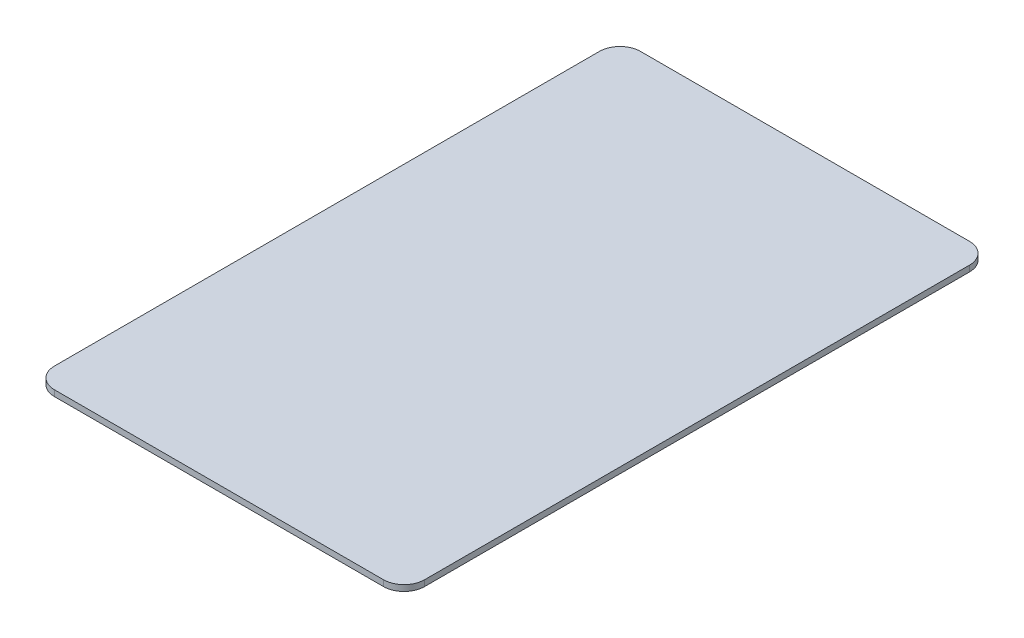
ISO-10303-21;
HEADER;
FILE_DESCRIPTION(('STEP AP214'),'2;1');
FILE_NAME('part.step','',(''),(''),'','','');
FILE_SCHEMA(('AUTOMOTIVE_DESIGN { 1 0 10303 214 1 1 1 1 }'));
ENDSEC;
DATA;
#1=APPLICATION_CONTEXT('core data for automotive mechanical design processes');
#2=APPLICATION_PROTOCOL_DEFINITION('international standard','automotive_design',2000,#1);
#3=PRODUCT_CONTEXT('',#1,'mechanical');
#4=PRODUCT('Part','Part','',(#3));
#5=PRODUCT_RELATED_PRODUCT_CATEGORY('part','',(#4));
#6=PRODUCT_DEFINITION_FORMATION('','',#4);
#7=PRODUCT_DEFINITION_CONTEXT('part definition',#1,'design');
#8=PRODUCT_DEFINITION('design','',#6,#7);
#9=PRODUCT_DEFINITION_SHAPE('','',#8);
#10=(LENGTH_UNIT() NAMED_UNIT(*) SI_UNIT(.MILLI.,.METRE.));
#11=(NAMED_UNIT(*) PLANE_ANGLE_UNIT() SI_UNIT($,.RADIAN.));
#12=(NAMED_UNIT(*) SI_UNIT($,.STERADIAN.) SOLID_ANGLE_UNIT());
#13=UNCERTAINTY_MEASURE_WITH_UNIT(LENGTH_MEASURE(1.E-05),#10,'distance_accuracy_value','');
#14=(GEOMETRIC_REPRESENTATION_CONTEXT(3) GLOBAL_UNCERTAINTY_ASSIGNED_CONTEXT((#13)) GLOBAL_UNIT_ASSIGNED_CONTEXT((#10,
#11,#12)) REPRESENTATION_CONTEXT('',''));
#15=CARTESIAN_POINT('',(0.,0.,0.));
#16=DIRECTION('',(0.,0.,1.));
#17=DIRECTION('',(1.,0.,0.));
#18=AXIS2_PLACEMENT_3D('',#15,#16,#17);
#19=CARTESIAN_POINT('',(24.,0.87,-39.75));
#20=DIRECTION('',(0.,-1.,0.));
#21=DIRECTION('',(0.,0.,-1.));
#22=AXIS2_PLACEMENT_3D('',#19,#20,#21);
#23=CYLINDRICAL_SURFACE('',#22,3.);
#24=CARTESIAN_POINT('',(24.,0.,-39.75));
#25=DIRECTION('',(0.,1.,0.));
#26=DIRECTION('',(0.,0.,-1.));
#27=AXIS2_PLACEMENT_3D('',#24,#25,#26);
#28=CIRCLE('',#27,3.);
#29=CARTESIAN_POINT('',(27.,0.,-39.75));
#30=VERTEX_POINT('',#29);
#31=CARTESIAN_POINT('',(24.,0.,-42.75));
#32=VERTEX_POINT('',#31);
#33=EDGE_CURVE('E140',#30,#32,#28,.T.);
#34=ORIENTED_EDGE('',*,*,#33,.T.);
#35=DIRECTION('',(0.,-1.,0.));
#36=VECTOR('',#35,1.);
#37=CARTESIAN_POINT('',(24.,0.87,-42.75));
#38=LINE('',#37,#36);
#39=CARTESIAN_POINT('',(24.,0.87,-42.75));
#40=VERTEX_POINT('',#39);
#41=EDGE_CURVE('E11',#40,#32,#38,.T.);
#42=ORIENTED_EDGE('',*,*,#41,.F.);
#43=CARTESIAN_POINT('',(24.,0.87,-39.75));
#44=DIRECTION('',(0.,1.,0.));
#45=DIRECTION('',(0.,0.,-1.));
#46=AXIS2_PLACEMENT_3D('',#43,#44,#45);
#47=CIRCLE('',#46,3.);
#48=CARTESIAN_POINT('',(27.,0.87,-39.75));
#49=VERTEX_POINT('',#48);
#50=EDGE_CURVE('E162',#49,#40,#47,.T.);
#51=ORIENTED_EDGE('',*,*,#50,.F.);
#52=DIRECTION('',(0.,-1.,0.));
#53=VECTOR('',#52,1.);
#54=CARTESIAN_POINT('',(27.,0.87,-39.75));
#55=LINE('',#54,#53);
#56=EDGE_CURVE('E136',#49,#30,#55,.T.);
#57=ORIENTED_EDGE('',*,*,#56,.T.);
#58=EDGE_LOOP('',(#34,#42,#51,#57));
#59=FACE_BOUND('',#58,.T.);
#60=ADVANCED_FACE('F39',(#59),#23,.T.);
#61=CARTESIAN_POINT('',(-24.,0.87,-42.75));
#62=DIRECTION('',(0.,0.,1.));
#63=DIRECTION('',(1.,0.,0.));
#64=AXIS2_PLACEMENT_3D('',#61,#62,#63);
#65=PLANE('',#64);
#66=DIRECTION('',(-1.,0.,0.));
#67=VECTOR('',#66,1.);
#68=CARTESIAN_POINT('',(-24.,0.,-42.75));
#69=LINE('',#68,#67);
#70=CARTESIAN_POINT('',(-24.,0.,-42.75));
#71=VERTEX_POINT('',#70);
#72=EDGE_CURVE('E144',#32,#71,#69,.T.);
#73=ORIENTED_EDGE('',*,*,#72,.T.);
#74=DIRECTION('',(0.,-1.,0.));
#75=VECTOR('',#74,1.);
#76=CARTESIAN_POINT('',(-24.,0.87,-42.75));
#77=LINE('',#76,#75);
#78=CARTESIAN_POINT('',(-24.,0.87,-42.75));
#79=VERTEX_POINT('',#78);
#80=EDGE_CURVE('E48',#79,#71,#77,.T.);
#81=ORIENTED_EDGE('',*,*,#80,.F.);
#82=DIRECTION('',(-1.,0.,0.));
#83=VECTOR('',#82,1.);
#84=CARTESIAN_POINT('',(-24.,0.87,-42.75));
#85=LINE('',#84,#83);
#86=EDGE_CURVE('E99',#40,#79,#85,.T.);
#87=ORIENTED_EDGE('',*,*,#86,.F.);
#88=ORIENTED_EDGE('',*,*,#41,.T.);
#89=EDGE_LOOP('',(#73,#81,#87,#88));
#90=FACE_BOUND('',#89,.T.);
#91=ADVANCED_FACE('F208',(#90),#65,.F.);
#92=CARTESIAN_POINT('',(-24.,0.87,-39.75));
#93=DIRECTION('',(0.,-1.,0.));
#94=DIRECTION('',(0.,0.,-1.));
#95=AXIS2_PLACEMENT_3D('',#92,#93,#94);
#96=CYLINDRICAL_SURFACE('',#95,3.);
#97=CARTESIAN_POINT('',(-24.,0.,-39.75));
#98=DIRECTION('',(0.,1.,0.));
#99=DIRECTION('',(0.,0.,-1.));
#100=AXIS2_PLACEMENT_3D('',#97,#98,#99);
#101=CIRCLE('',#100,3.);
#102=CARTESIAN_POINT('',(-27.,0.,-39.75));
#103=VERTEX_POINT('',#102);
#104=EDGE_CURVE('E147',#71,#103,#101,.T.);
#105=ORIENTED_EDGE('',*,*,#104,.T.);
#106=DIRECTION('',(0.,-1.,0.));
#107=VECTOR('',#106,1.);
#108=CARTESIAN_POINT('',(-27.,0.87,-39.75));
#109=LINE('',#108,#107);
#110=CARTESIAN_POINT('',(-27.,0.87,-39.75));
#111=VERTEX_POINT('',#110);
#112=EDGE_CURVE('E173',#111,#103,#109,.T.);
#113=ORIENTED_EDGE('',*,*,#112,.F.);
#114=CARTESIAN_POINT('',(-24.,0.87,-39.75));
#115=DIRECTION('',(0.,1.,0.));
#116=DIRECTION('',(0.,0.,-1.));
#117=AXIS2_PLACEMENT_3D('',#114,#115,#116);
#118=CIRCLE('',#117,3.);
#119=EDGE_CURVE('E183',#79,#111,#118,.T.);
#120=ORIENTED_EDGE('',*,*,#119,.F.);
#121=ORIENTED_EDGE('',*,*,#80,.T.);
#122=EDGE_LOOP('',(#105,#113,#120,#121));
#123=FACE_BOUND('',#122,.T.);
#124=ADVANCED_FACE('F181',(#123),#96,.T.);
#125=CARTESIAN_POINT('',(-27.,0.87,39.75));
#126=DIRECTION('',(1.,0.,0.));
#127=DIRECTION('',(0.,0.,-1.));
#128=AXIS2_PLACEMENT_3D('',#125,#126,#127);
#129=PLANE('',#128);
#130=DIRECTION('',(0.,0.,1.));
#131=VECTOR('',#130,1.);
#132=CARTESIAN_POINT('',(-27.,0.,39.75));
#133=LINE('',#132,#131);
#134=CARTESIAN_POINT('',(-27.,0.,39.75));
#135=VERTEX_POINT('',#134);
#136=EDGE_CURVE('E150',#103,#135,#133,.T.);
#137=ORIENTED_EDGE('',*,*,#136,.T.);
#138=DIRECTION('',(0.,-1.,0.));
#139=VECTOR('',#138,1.);
#140=CARTESIAN_POINT('',(-27.,0.87,39.75));
#141=LINE('',#140,#139);
#142=CARTESIAN_POINT('',(-27.,0.87,39.75));
#143=VERTEX_POINT('',#142);
#144=EDGE_CURVE('E169',#143,#135,#141,.T.);
#145=ORIENTED_EDGE('',*,*,#144,.F.);
#146=DIRECTION('',(0.,0.,1.));
#147=VECTOR('',#146,1.);
#148=CARTESIAN_POINT('',(-27.,0.87,39.75));
#149=LINE('',#148,#147);
#150=EDGE_CURVE('E196',#111,#143,#149,.T.);
#151=ORIENTED_EDGE('',*,*,#150,.F.);
#152=ORIENTED_EDGE('',*,*,#112,.T.);
#153=EDGE_LOOP('',(#137,#145,#151,#152));
#154=FACE_BOUND('',#153,.T.);
#155=ADVANCED_FACE('F191',(#154),#129,.F.);
#156=CARTESIAN_POINT('',(-24.,0.87,39.75));
#157=DIRECTION('',(0.,-1.,0.));
#158=DIRECTION('',(0.,0.,-1.));
#159=AXIS2_PLACEMENT_3D('',#156,#157,#158);
#160=CYLINDRICAL_SURFACE('',#159,3.);
#161=CARTESIAN_POINT('',(-24.,0.,39.75));
#162=DIRECTION('',(0.,1.,0.));
#163=DIRECTION('',(0.,0.,-1.));
#164=AXIS2_PLACEMENT_3D('',#161,#162,#163);
#165=CIRCLE('',#164,3.);
#166=CARTESIAN_POINT('',(-24.,0.,42.75));
#167=VERTEX_POINT('',#166);
#168=EDGE_CURVE('E153',#135,#167,#165,.T.);
#169=ORIENTED_EDGE('',*,*,#168,.T.);
#170=DIRECTION('',(0.,-1.,0.));
#171=VECTOR('',#170,1.);
#172=CARTESIAN_POINT('',(-24.,0.87,42.75));
#173=LINE('',#172,#171);
#174=CARTESIAN_POINT('',(-24.,0.87,42.75));
#175=VERTEX_POINT('',#174);
#176=EDGE_CURVE('E129',#175,#167,#173,.T.);
#177=ORIENTED_EDGE('',*,*,#176,.F.);
#178=CARTESIAN_POINT('',(-24.,0.87,39.75));
#179=DIRECTION('',(0.,1.,0.));
#180=DIRECTION('',(0.,0.,-1.));
#181=AXIS2_PLACEMENT_3D('',#178,#179,#180);
#182=CIRCLE('',#181,3.);
#183=EDGE_CURVE('E118',#143,#175,#182,.T.);
#184=ORIENTED_EDGE('',*,*,#183,.F.);
#185=ORIENTED_EDGE('',*,*,#144,.T.);
#186=EDGE_LOOP('',(#169,#177,#184,#185));
#187=FACE_BOUND('',#186,.T.);
#188=ADVANCED_FACE('F194',(#187),#160,.T.);
#189=CARTESIAN_POINT('',(-24.,0.87,42.75));
#190=DIRECTION('',(0.,0.,-1.));
#191=DIRECTION('',(-1.,0.,0.));
#192=AXIS2_PLACEMENT_3D('',#189,#190,#191);
#193=PLANE('',#192);
#194=DIRECTION('',(1.,0.,0.));
#195=VECTOR('',#194,1.);
#196=CARTESIAN_POINT('',(-24.,0.,42.75));
#197=LINE('',#196,#195);
#198=CARTESIAN_POINT('',(24.,0.,42.75));
#199=VERTEX_POINT('',#198);
#200=EDGE_CURVE('E127',#167,#199,#197,.T.);
#201=ORIENTED_EDGE('',*,*,#200,.T.);
#202=DIRECTION('',(0.,-1.,0.));
#203=VECTOR('',#202,1.);
#204=CARTESIAN_POINT('',(24.,0.87,42.75));
#205=LINE('',#204,#203);
#206=CARTESIAN_POINT('',(24.,0.87,42.75));
#207=VERTEX_POINT('',#206);
#208=EDGE_CURVE('E124',#207,#199,#205,.T.);
#209=ORIENTED_EDGE('',*,*,#208,.F.);
#210=DIRECTION('',(1.,0.,0.));
#211=VECTOR('',#210,1.);
#212=CARTESIAN_POINT('',(-24.,0.87,42.75));
#213=LINE('',#212,#211);
#214=EDGE_CURVE('E112',#175,#207,#213,.T.);
#215=ORIENTED_EDGE('',*,*,#214,.F.);
#216=ORIENTED_EDGE('',*,*,#176,.T.);
#217=EDGE_LOOP('',(#201,#209,#215,#216));
#218=FACE_BOUND('',#217,.T.);
#219=ADVANCED_FACE('F125',(#218),#193,.F.);
#220=CARTESIAN_POINT('',(24.,0.87,39.75));
#221=DIRECTION('',(0.,-1.,0.));
#222=DIRECTION('',(0.,0.,-1.));
#223=AXIS2_PLACEMENT_3D('',#220,#221,#222);
#224=CYLINDRICAL_SURFACE('',#223,3.);
#225=CARTESIAN_POINT('',(24.,0.,39.75));
#226=DIRECTION('',(0.,1.,0.));
#227=DIRECTION('',(0.,0.,-1.));
#228=AXIS2_PLACEMENT_3D('',#225,#226,#227);
#229=CIRCLE('',#228,3.);
#230=CARTESIAN_POINT('',(27.,0.,39.75));
#231=VERTEX_POINT('',#230);
#232=EDGE_CURVE('E85',#199,#231,#229,.T.);
#233=ORIENTED_EDGE('',*,*,#232,.T.);
#234=DIRECTION('',(0.,-1.,0.));
#235=VECTOR('',#234,1.);
#236=CARTESIAN_POINT('',(27.,0.87,39.75));
#237=LINE('',#236,#235);
#238=CARTESIAN_POINT('',(27.,0.87,39.75));
#239=VERTEX_POINT('',#238);
#240=EDGE_CURVE('E130',#239,#231,#237,.T.);
#241=ORIENTED_EDGE('',*,*,#240,.F.);
#242=CARTESIAN_POINT('',(24.,0.87,39.75));
#243=DIRECTION('',(0.,1.,0.));
#244=DIRECTION('',(0.,0.,-1.));
#245=AXIS2_PLACEMENT_3D('',#242,#243,#244);
#246=CIRCLE('',#245,3.);
#247=EDGE_CURVE('E116',#207,#239,#246,.T.);
#248=ORIENTED_EDGE('',*,*,#247,.F.);
#249=ORIENTED_EDGE('',*,*,#208,.T.);
#250=EDGE_LOOP('',(#233,#241,#248,#249));
#251=FACE_BOUND('',#250,.T.);
#252=ADVANCED_FACE('F132',(#251),#224,.T.);
#253=CARTESIAN_POINT('',(27.,0.87,39.75));
#254=DIRECTION('',(-1.,0.,0.));
#255=DIRECTION('',(0.,0.,1.));
#256=AXIS2_PLACEMENT_3D('',#253,#254,#255);
#257=PLANE('',#256);
#258=DIRECTION('',(0.,0.,-1.));
#259=VECTOR('',#258,1.);
#260=CARTESIAN_POINT('',(27.,0.,39.75));
#261=LINE('',#260,#259);
#262=EDGE_CURVE('E91',#231,#30,#261,.T.);
#263=ORIENTED_EDGE('',*,*,#262,.T.);
#264=ORIENTED_EDGE('',*,*,#56,.F.);
#265=DIRECTION('',(0.,0.,-1.));
#266=VECTOR('',#265,1.);
#267=CARTESIAN_POINT('',(27.,0.87,39.75));
#268=LINE('',#267,#266);
#269=EDGE_CURVE('E56',#239,#49,#268,.T.);
#270=ORIENTED_EDGE('',*,*,#269,.F.);
#271=ORIENTED_EDGE('',*,*,#240,.T.);
#272=EDGE_LOOP('',(#263,#264,#270,#271));
#273=FACE_BOUND('',#272,.T.);
#274=ADVANCED_FACE('F224',(#273),#257,.F.);
#275=CARTESIAN_POINT('',(24.,0.87,-39.75));
#276=DIRECTION('',(0.,-1.,0.));
#277=DIRECTION('',(0.,0.,-1.));
#278=AXIS2_PLACEMENT_3D('',#275,#276,#277);
#279=PLANE('',#278);
#280=ORIENTED_EDGE('',*,*,#50,.T.);
#281=ORIENTED_EDGE('',*,*,#86,.T.);
#282=ORIENTED_EDGE('',*,*,#119,.T.);
#283=ORIENTED_EDGE('',*,*,#150,.T.);
#284=ORIENTED_EDGE('',*,*,#183,.T.);
#285=ORIENTED_EDGE('',*,*,#214,.T.);
#286=ORIENTED_EDGE('',*,*,#247,.T.);
#287=ORIENTED_EDGE('',*,*,#269,.T.);
#288=EDGE_LOOP('',(#280,#281,#282,#283,#284,#285,#286,#287));
#289=FACE_BOUND('',#288,.T.);
#290=ADVANCED_FACE('F114',(#289),#279,.F.);
#291=CARTESIAN_POINT('',(24.,0.,-39.75));
#292=DIRECTION('',(0.,-1.,0.));
#293=DIRECTION('',(0.,0.,-1.));
#294=AXIS2_PLACEMENT_3D('',#291,#292,#293);
#295=PLANE('',#294);
#296=ORIENTED_EDGE('',*,*,#33,.F.);
#297=ORIENTED_EDGE('',*,*,#262,.F.);
#298=ORIENTED_EDGE('',*,*,#232,.F.);
#299=ORIENTED_EDGE('',*,*,#200,.F.);
#300=ORIENTED_EDGE('',*,*,#168,.F.);
#301=ORIENTED_EDGE('',*,*,#136,.F.);
#302=ORIENTED_EDGE('',*,*,#104,.F.);
#303=ORIENTED_EDGE('',*,*,#72,.F.);
#304=EDGE_LOOP('',(#296,#297,#298,#299,#300,#301,#302,#303));
#305=FACE_BOUND('',#304,.T.);
#306=ADVANCED_FACE('F187',(#305),#295,.T.);
#307=CLOSED_SHELL('',(#60,#91,#124,#155,#188,#219,#252,#274,#290,#306));
#308=MANIFOLD_SOLID_BREP('B2',#307);
#309=ADVANCED_BREP_SHAPE_REPRESENTATION('',(#18,#308),#14);
#310=SHAPE_DEFINITION_REPRESENTATION(#9,#309);
ENDSEC;
END-ISO-10303-21;
